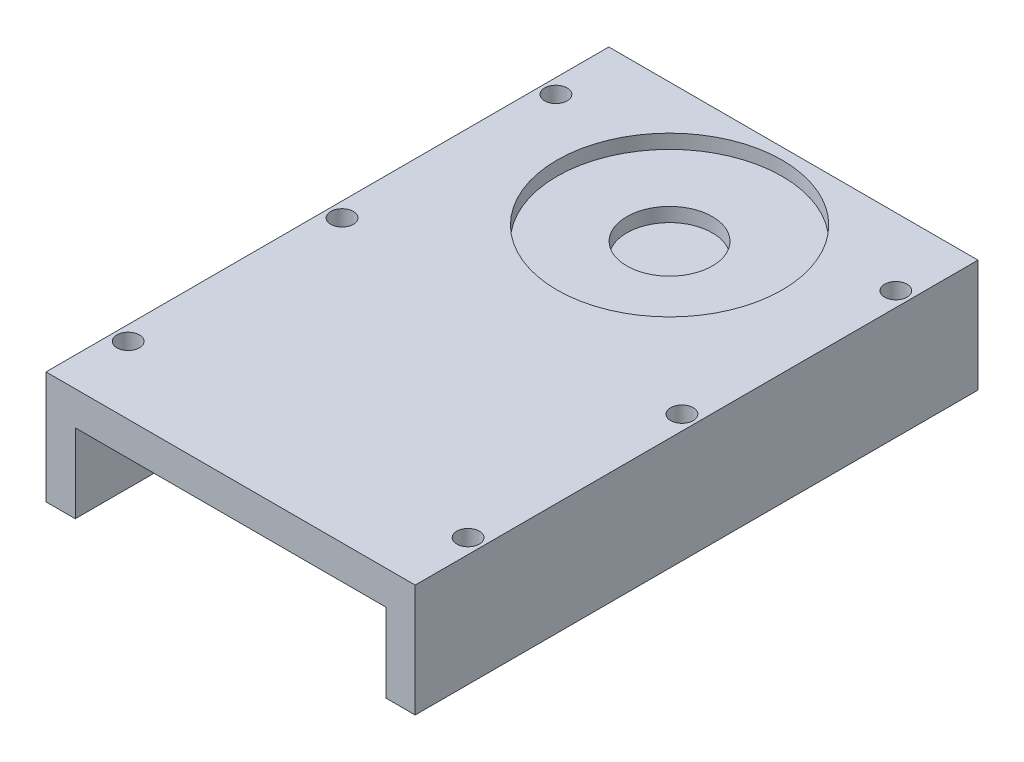
ISO-10303-21;
HEADER;
FILE_DESCRIPTION(('STEP AP214'),'2;1');
FILE_NAME('part.step','',(''),(''),'','','');
FILE_SCHEMA(('AUTOMOTIVE_DESIGN { 1 0 10303 214 1 1 1 1 }'));
ENDSEC;
DATA;
#1=APPLICATION_CONTEXT('core data for automotive mechanical design processes');
#2=APPLICATION_PROTOCOL_DEFINITION('international standard','automotive_design',2000,#1);
#3=PRODUCT_CONTEXT('',#1,'mechanical');
#4=PRODUCT('Part','Part','',(#3));
#5=PRODUCT_RELATED_PRODUCT_CATEGORY('part','',(#4));
#6=PRODUCT_DEFINITION_FORMATION('','',#4);
#7=PRODUCT_DEFINITION_CONTEXT('part definition',#1,'design');
#8=PRODUCT_DEFINITION('design','',#6,#7);
#9=PRODUCT_DEFINITION_SHAPE('','',#8);
#10=(LENGTH_UNIT() NAMED_UNIT(*) SI_UNIT(.MILLI.,.METRE.));
#11=(NAMED_UNIT(*) PLANE_ANGLE_UNIT() SI_UNIT($,.RADIAN.));
#12=(NAMED_UNIT(*) SI_UNIT($,.STERADIAN.) SOLID_ANGLE_UNIT());
#13=UNCERTAINTY_MEASURE_WITH_UNIT(LENGTH_MEASURE(1.E-05),#10,'distance_accuracy_value','');
#14=(GEOMETRIC_REPRESENTATION_CONTEXT(3) GLOBAL_UNCERTAINTY_ASSIGNED_CONTEXT((#13)) GLOBAL_UNIT_ASSIGNED_CONTEXT((#10,
#11,#12)) REPRESENTATION_CONTEXT('',''));
#15=CARTESIAN_POINT('',(0.,0.,0.));
#16=DIRECTION('',(0.,0.,1.));
#17=DIRECTION('',(1.,0.,0.));
#18=AXIS2_PLACEMENT_3D('',#15,#16,#17);
#19=CARTESIAN_POINT('',(-20.828,-8.89,63.5));
#20=DIRECTION('',(1.,0.,0.));
#21=DIRECTION('',(0.,0.,-1.));
#22=AXIS2_PLACEMENT_3D('',#19,#20,#21);
#23=PLANE('',#22);
#24=DIRECTION('',(0.,-1.,0.));
#25=VECTOR('',#24,1.);
#26=CARTESIAN_POINT('',(-20.828,-8.89,0.));
#27=LINE('',#26,#25);
#28=CARTESIAN_POINT('',(-20.828,3.81,0.));
#29=VERTEX_POINT('',#28);
#30=CARTESIAN_POINT('',(-20.828,-8.89,0.));
#31=VERTEX_POINT('',#30);
#32=EDGE_CURVE('E137',#29,#31,#27,.T.);
#33=ORIENTED_EDGE('',*,*,#32,.T.);
#34=DIRECTION('',(0.,0.,-1.));
#35=VECTOR('',#34,1.);
#36=CARTESIAN_POINT('',(-20.828,-8.89,63.5));
#37=LINE('',#36,#35);
#38=CARTESIAN_POINT('',(-20.828,-8.89,63.5));
#39=VERTEX_POINT('',#38);
#40=EDGE_CURVE('E44',#39,#31,#37,.T.);
#41=ORIENTED_EDGE('',*,*,#40,.F.);
#42=DIRECTION('',(0.,-1.,0.));
#43=VECTOR('',#42,1.);
#44=CARTESIAN_POINT('',(-20.828,-8.89,63.5));
#45=LINE('',#44,#43);
#46=CARTESIAN_POINT('',(-20.828,3.81,63.5));
#47=VERTEX_POINT('',#46);
#48=EDGE_CURVE('E97',#47,#39,#45,.T.);
#49=ORIENTED_EDGE('',*,*,#48,.F.);
#50=DIRECTION('',(0.,0.,-1.));
#51=VECTOR('',#50,1.);
#52=CARTESIAN_POINT('',(-20.828,3.81,63.5));
#53=LINE('',#52,#51);
#54=EDGE_CURVE('E11',#47,#29,#53,.T.);
#55=ORIENTED_EDGE('',*,*,#54,.T.);
#56=EDGE_LOOP('',(#33,#41,#49,#55));
#57=FACE_BOUND('',#56,.T.);
#58=ADVANCED_FACE('F35',(#57),#23,.F.);
#59=CARTESIAN_POINT('',(-17.526,-8.89,63.5));
#60=DIRECTION('',(0.,1.,0.));
#61=DIRECTION('',(-1.,0.,0.));
#62=AXIS2_PLACEMENT_3D('',#59,#60,#61);
#63=PLANE('',#62);
#64=CARTESIAN_POINT('',(-19.177,-8.89,7.62));
#65=DIRECTION('',(0.,-1.,0.));
#66=DIRECTION('',(1.,0.,0.));
#67=AXIS2_PLACEMENT_3D('',#64,#65,#66);
#68=CIRCLE('',#67,1.27);
#69=CARTESIAN_POINT('',(-17.907,-8.89,7.62));
#70=VERTEX_POINT('',#69);
#71=EDGE_CURVE('E166',#70,#70,#68,.T.);
#72=ORIENTED_EDGE('',*,*,#71,.F.);
#73=EDGE_LOOP('',(#72));
#74=FACE_BOUND('',#73,.T.);
#75=CARTESIAN_POINT('',(-19.177,-8.89,55.88));
#76=DIRECTION('',(0.,-1.,0.));
#77=DIRECTION('',(1.,0.,0.));
#78=AXIS2_PLACEMENT_3D('',#75,#76,#77);
#79=CIRCLE('',#78,1.27);
#80=CARTESIAN_POINT('',(-17.907,-8.89,55.88));
#81=VERTEX_POINT('',#80);
#82=EDGE_CURVE('E183',#81,#81,#79,.T.);
#83=ORIENTED_EDGE('',*,*,#82,.F.);
#84=EDGE_LOOP('',(#83));
#85=FACE_BOUND('',#84,.T.);
#86=CARTESIAN_POINT('',(-19.177,-8.89,31.75));
#87=DIRECTION('',(0.,-1.,0.));
#88=DIRECTION('',(1.,0.,0.));
#89=AXIS2_PLACEMENT_3D('',#86,#87,#88);
#90=CIRCLE('',#89,1.27);
#91=CARTESIAN_POINT('',(-17.907,-8.89,31.75));
#92=VERTEX_POINT('',#91);
#93=EDGE_CURVE('E179',#92,#92,#90,.T.);
#94=ORIENTED_EDGE('',*,*,#93,.F.);
#95=EDGE_LOOP('',(#94));
#96=FACE_BOUND('',#95,.T.);
#97=DIRECTION('',(1.,0.,0.));
#98=VECTOR('',#97,1.);
#99=CARTESIAN_POINT('',(-17.526,-8.89,0.));
#100=LINE('',#99,#98);
#101=CARTESIAN_POINT('',(-17.526,-8.89,0.));
#102=VERTEX_POINT('',#101);
#103=EDGE_CURVE('E139',#31,#102,#100,.T.);
#104=ORIENTED_EDGE('',*,*,#103,.T.);
#105=DIRECTION('',(0.,0.,-1.));
#106=VECTOR('',#105,1.);
#107=CARTESIAN_POINT('',(-17.526,-8.89,63.5));
#108=LINE('',#107,#106);
#109=CARTESIAN_POINT('',(-17.526,-8.89,63.5));
#110=VERTEX_POINT('',#109);
#111=EDGE_CURVE('E157',#110,#102,#108,.T.);
#112=ORIENTED_EDGE('',*,*,#111,.F.);
#113=DIRECTION('',(1.,0.,0.));
#114=VECTOR('',#113,1.);
#115=CARTESIAN_POINT('',(-17.526,-8.89,63.5));
#116=LINE('',#115,#114);
#117=EDGE_CURVE('E193',#39,#110,#116,.T.);
#118=ORIENTED_EDGE('',*,*,#117,.F.);
#119=ORIENTED_EDGE('',*,*,#40,.T.);
#120=EDGE_LOOP('',(#104,#112,#118,#119));
#121=FACE_BOUND('',#120,.T.);
#122=ADVANCED_FACE('F214',(#74,#85,#96,#121),#63,.F.);
#123=CARTESIAN_POINT('',(-17.526,0.,63.5));
#124=DIRECTION('',(-1.,0.,0.));
#125=DIRECTION('',(0.,0.,1.));
#126=AXIS2_PLACEMENT_3D('',#123,#124,#125);
#127=PLANE('',#126);
#128=DIRECTION('',(0.,1.,0.));
#129=VECTOR('',#128,1.);
#130=CARTESIAN_POINT('',(-17.526,0.,0.));
#131=LINE('',#130,#129);
#132=CARTESIAN_POINT('',(-17.526,0.,0.));
#133=VERTEX_POINT('',#132);
#134=EDGE_CURVE('E142',#102,#133,#131,.T.);
#135=ORIENTED_EDGE('',*,*,#134,.T.);
#136=DIRECTION('',(0.,0.,-1.));
#137=VECTOR('',#136,1.);
#138=CARTESIAN_POINT('',(-17.526,0.,63.5));
#139=LINE('',#138,#137);
#140=CARTESIAN_POINT('',(-17.526,0.,63.5));
#141=VERTEX_POINT('',#140);
#142=EDGE_CURVE('E154',#141,#133,#139,.T.);
#143=ORIENTED_EDGE('',*,*,#142,.F.);
#144=DIRECTION('',(0.,1.,0.));
#145=VECTOR('',#144,1.);
#146=CARTESIAN_POINT('',(-17.526,0.,63.5));
#147=LINE('',#146,#145);
#148=EDGE_CURVE('E195',#110,#141,#147,.T.);
#149=ORIENTED_EDGE('',*,*,#148,.F.);
#150=ORIENTED_EDGE('',*,*,#111,.T.);
#151=EDGE_LOOP('',(#135,#143,#149,#150));
#152=FACE_BOUND('',#151,.T.);
#153=ADVANCED_FACE('F201',(#152),#127,.F.);
#154=CARTESIAN_POINT('',(17.526,0.,63.5));
#155=DIRECTION('',(0.,1.,0.));
#156=DIRECTION('',(0.,0.,1.));
#157=AXIS2_PLACEMENT_3D('',#154,#155,#156);
#158=PLANE('',#157);
#159=DIRECTION('',(1.,0.,0.));
#160=VECTOR('',#159,1.);
#161=CARTESIAN_POINT('',(17.526,0.,0.));
#162=LINE('',#161,#160);
#163=CARTESIAN_POINT('',(17.526,0.,0.));
#164=VERTEX_POINT('',#163);
#165=EDGE_CURVE('E144',#133,#164,#162,.T.);
#166=ORIENTED_EDGE('',*,*,#165,.T.);
#167=DIRECTION('',(0.,0.,-1.));
#168=VECTOR('',#167,1.);
#169=CARTESIAN_POINT('',(17.526,0.,63.5));
#170=LINE('',#169,#168);
#171=CARTESIAN_POINT('',(17.526,0.,63.5));
#172=VERTEX_POINT('',#171);
#173=EDGE_CURVE('E126',#172,#164,#170,.T.);
#174=ORIENTED_EDGE('',*,*,#173,.F.);
#175=DIRECTION('',(1.,0.,0.));
#176=VECTOR('',#175,1.);
#177=CARTESIAN_POINT('',(17.526,0.,63.5));
#178=LINE('',#177,#176);
#179=EDGE_CURVE('E117',#141,#172,#178,.T.);
#180=ORIENTED_EDGE('',*,*,#179,.F.);
#181=ORIENTED_EDGE('',*,*,#142,.T.);
#182=EDGE_LOOP('',(#166,#174,#180,#181));
#183=FACE_BOUND('',#182,.T.);
#184=ADVANCED_FACE('F205',(#183),#158,.F.);
#185=CARTESIAN_POINT('',(17.526,-8.89,63.5));
#186=DIRECTION('',(1.,0.,0.));
#187=DIRECTION('',(0.,0.,-1.));
#188=AXIS2_PLACEMENT_3D('',#185,#186,#187);
#189=PLANE('',#188);
#190=DIRECTION('',(0.,-1.,0.));
#191=VECTOR('',#190,1.);
#192=CARTESIAN_POINT('',(17.526,-8.89,0.));
#193=LINE('',#192,#191);
#194=CARTESIAN_POINT('',(17.526,-8.89,0.));
#195=VERTEX_POINT('',#194);
#196=EDGE_CURVE('E125',#164,#195,#193,.T.);
#197=ORIENTED_EDGE('',*,*,#196,.T.);
#198=DIRECTION('',(0.,0.,-1.));
#199=VECTOR('',#198,1.);
#200=CARTESIAN_POINT('',(17.526,-8.89,63.5));
#201=LINE('',#200,#199);
#202=CARTESIAN_POINT('',(17.526,-8.89,63.5));
#203=VERTEX_POINT('',#202);
#204=EDGE_CURVE('E122',#203,#195,#201,.T.);
#205=ORIENTED_EDGE('',*,*,#204,.F.);
#206=DIRECTION('',(0.,-1.,0.));
#207=VECTOR('',#206,1.);
#208=CARTESIAN_POINT('',(17.526,-8.89,63.5));
#209=LINE('',#208,#207);
#210=EDGE_CURVE('E111',#172,#203,#209,.T.);
#211=ORIENTED_EDGE('',*,*,#210,.F.);
#212=ORIENTED_EDGE('',*,*,#173,.T.);
#213=EDGE_LOOP('',(#197,#205,#211,#212));
#214=FACE_BOUND('',#213,.T.);
#215=ADVANCED_FACE('F123',(#214),#189,.F.);
#216=CARTESIAN_POINT('',(20.828,-8.89,63.5));
#217=DIRECTION('',(0.,1.,0.));
#218=DIRECTION('',(-1.,0.,0.));
#219=AXIS2_PLACEMENT_3D('',#216,#217,#218);
#220=PLANE('',#219);
#221=CARTESIAN_POINT('',(19.177,-8.89,7.62));
#222=DIRECTION('',(0.,1.,0.));
#223=DIRECTION('',(-1.,0.,0.));
#224=AXIS2_PLACEMENT_3D('',#221,#222,#223);
#225=CIRCLE('',#224,1.27);
#226=CARTESIAN_POINT('',(17.907,-8.89,7.62));
#227=VERTEX_POINT('',#226);
#228=EDGE_CURVE('E174',#227,#227,#225,.T.);
#229=ORIENTED_EDGE('',*,*,#228,.T.);
#230=EDGE_LOOP('',(#229));
#231=FACE_BOUND('',#230,.T.);
#232=CARTESIAN_POINT('',(19.177,-8.89,55.88));
#233=DIRECTION('',(0.,1.,0.));
#234=DIRECTION('',(-1.,0.,0.));
#235=AXIS2_PLACEMENT_3D('',#232,#233,#234);
#236=CIRCLE('',#235,1.27);
#237=CARTESIAN_POINT('',(17.907,-8.89,55.88));
#238=VERTEX_POINT('',#237);
#239=EDGE_CURVE('E298',#238,#238,#236,.T.);
#240=ORIENTED_EDGE('',*,*,#239,.T.);
#241=EDGE_LOOP('',(#240));
#242=FACE_BOUND('',#241,.T.);
#243=CARTESIAN_POINT('',(19.177,-8.89,31.75));
#244=DIRECTION('',(0.,1.,0.));
#245=DIRECTION('',(-1.,0.,0.));
#246=AXIS2_PLACEMENT_3D('',#243,#244,#245);
#247=CIRCLE('',#246,1.27);
#248=CARTESIAN_POINT('',(17.907,-8.89,31.75));
#249=VERTEX_POINT('',#248);
#250=EDGE_CURVE('E294',#249,#249,#247,.T.);
#251=ORIENTED_EDGE('',*,*,#250,.T.);
#252=EDGE_LOOP('',(#251));
#253=FACE_BOUND('',#252,.T.);
#254=DIRECTION('',(1.,0.,0.));
#255=VECTOR('',#254,1.);
#256=CARTESIAN_POINT('',(20.828,-8.89,0.));
#257=LINE('',#256,#255);
#258=CARTESIAN_POINT('',(20.828,-8.89,0.));
#259=VERTEX_POINT('',#258);
#260=EDGE_CURVE('E83',#195,#259,#257,.T.);
#261=ORIENTED_EDGE('',*,*,#260,.T.);
#262=DIRECTION('',(0.,0.,-1.));
#263=VECTOR('',#262,1.);
#264=CARTESIAN_POINT('',(20.828,-8.89,63.5));
#265=LINE('',#264,#263);
#266=CARTESIAN_POINT('',(20.828,-8.89,63.5));
#267=VERTEX_POINT('',#266);
#268=EDGE_CURVE('E127',#267,#259,#265,.T.);
#269=ORIENTED_EDGE('',*,*,#268,.F.);
#270=DIRECTION('',(1.,0.,0.));
#271=VECTOR('',#270,1.);
#272=CARTESIAN_POINT('',(20.828,-8.89,63.5));
#273=LINE('',#272,#271);
#274=EDGE_CURVE('E115',#203,#267,#273,.T.);
#275=ORIENTED_EDGE('',*,*,#274,.F.);
#276=ORIENTED_EDGE('',*,*,#204,.T.);
#277=EDGE_LOOP('',(#261,#269,#275,#276));
#278=FACE_BOUND('',#277,.T.);
#279=ADVANCED_FACE('F129',(#231,#242,#253,#278),#220,.F.);
#280=CARTESIAN_POINT('',(20.828,3.81,63.5));
#281=DIRECTION('',(-1.,0.,0.));
#282=DIRECTION('',(0.,0.,1.));
#283=AXIS2_PLACEMENT_3D('',#280,#281,#282);
#284=PLANE('',#283);
#285=DIRECTION('',(0.,1.,0.));
#286=VECTOR('',#285,1.);
#287=CARTESIAN_POINT('',(20.828,3.81,0.));
#288=LINE('',#287,#286);
#289=CARTESIAN_POINT('',(20.828,3.81,0.));
#290=VERTEX_POINT('',#289);
#291=EDGE_CURVE('E90',#259,#290,#288,.T.);
#292=ORIENTED_EDGE('',*,*,#291,.T.);
#293=DIRECTION('',(0.,0.,-1.));
#294=VECTOR('',#293,1.);
#295=CARTESIAN_POINT('',(20.828,3.81,63.5));
#296=LINE('',#295,#294);
#297=CARTESIAN_POINT('',(20.828,3.81,63.5));
#298=VERTEX_POINT('',#297);
#299=EDGE_CURVE('E133',#298,#290,#296,.T.);
#300=ORIENTED_EDGE('',*,*,#299,.F.);
#301=DIRECTION('',(0.,1.,0.));
#302=VECTOR('',#301,1.);
#303=CARTESIAN_POINT('',(20.828,3.81,63.5));
#304=LINE('',#303,#302);
#305=EDGE_CURVE('E131',#267,#298,#304,.T.);
#306=ORIENTED_EDGE('',*,*,#305,.F.);
#307=ORIENTED_EDGE('',*,*,#268,.T.);
#308=EDGE_LOOP('',(#292,#300,#306,#307));
#309=FACE_BOUND('',#308,.T.);
#310=ADVANCED_FACE('F212',(#309),#284,.F.);
#311=CARTESIAN_POINT('',(-18.3144583333333,3.81,63.5));
#312=DIRECTION('',(0.,-1.,0.));
#313=DIRECTION('',(0.,0.,-1.));
#314=AXIS2_PLACEMENT_3D('',#311,#312,#313);
#315=PLANE('',#314);
#316=CARTESIAN_POINT('',(0.,3.81,13.97));
#317=DIRECTION('',(0.,1.,0.));
#318=DIRECTION('',(-1.,0.,0.));
#319=AXIS2_PLACEMENT_3D('',#316,#317,#318);
#320=CIRCLE('',#319,12.7);
#321=CARTESIAN_POINT('',(-12.7,3.81,13.97));
#322=VERTEX_POINT('',#321);
#323=EDGE_CURVE('E284',#322,#322,#320,.T.);
#324=ORIENTED_EDGE('',*,*,#323,.F.);
#325=EDGE_LOOP('',(#324));
#326=FACE_BOUND('',#325,.T.);
#327=CARTESIAN_POINT('',(19.177,3.80999999999999,7.62));
#328=DIRECTION('',(0.,-1.,0.));
#329=DIRECTION('',(0.,0.,-1.));
#330=AXIS2_PLACEMENT_3D('',#327,#328,#329);
#331=CIRCLE('',#330,1.27);
#332=CARTESIAN_POINT('',(19.177,3.80999999999999,6.35));
#333=VERTEX_POINT('',#332);
#334=EDGE_CURVE('E38',#333,#333,#331,.F.);
#335=ORIENTED_EDGE('',*,*,#334,.F.);
#336=EDGE_LOOP('',(#335));
#337=FACE_BOUND('',#336,.T.);
#338=CARTESIAN_POINT('',(19.177,3.80999999999999,55.88));
#339=DIRECTION('',(0.,-1.,0.));
#340=DIRECTION('',(0.,0.,-1.));
#341=AXIS2_PLACEMENT_3D('',#338,#339,#340);
#342=CIRCLE('',#341,1.27);
#343=CARTESIAN_POINT('',(19.177,3.80999999999999,54.61));
#344=VERTEX_POINT('',#343);
#345=EDGE_CURVE('E173',#344,#344,#342,.F.);
#346=ORIENTED_EDGE('',*,*,#345,.F.);
#347=EDGE_LOOP('',(#346));
#348=FACE_BOUND('',#347,.T.);
#349=CARTESIAN_POINT('',(19.177,3.80999999999999,31.75));
#350=DIRECTION('',(0.,-1.,0.));
#351=DIRECTION('',(0.,0.,-1.));
#352=AXIS2_PLACEMENT_3D('',#349,#350,#351);
#353=CIRCLE('',#352,1.27);
#354=CARTESIAN_POINT('',(19.177,3.80999999999999,30.48));
#355=VERTEX_POINT('',#354);
#356=EDGE_CURVE('E171',#355,#355,#353,.F.);
#357=ORIENTED_EDGE('',*,*,#356,.F.);
#358=EDGE_LOOP('',(#357));
#359=FACE_BOUND('',#358,.T.);
#360=CARTESIAN_POINT('',(-19.177,3.80999999999999,7.62));
#361=DIRECTION('',(0.,-1.,0.));
#362=DIRECTION('',(0.,0.,-1.));
#363=AXIS2_PLACEMENT_3D('',#360,#361,#362);
#364=CIRCLE('',#363,1.27);
#365=CARTESIAN_POINT('',(-19.177,3.80999999999999,6.35));
#366=VERTEX_POINT('',#365);
#367=EDGE_CURVE('E140',#366,#366,#364,.T.);
#368=ORIENTED_EDGE('',*,*,#367,.T.);
#369=EDGE_LOOP('',(#368));
#370=FACE_BOUND('',#369,.T.);
#371=CARTESIAN_POINT('',(-19.177,3.80999999999999,55.88));
#372=DIRECTION('',(0.,-1.,0.));
#373=DIRECTION('',(0.,0.,-1.));
#374=AXIS2_PLACEMENT_3D('',#371,#372,#373);
#375=CIRCLE('',#374,1.27);
#376=CARTESIAN_POINT('',(-19.177,3.80999999999999,54.61));
#377=VERTEX_POINT('',#376);
#378=EDGE_CURVE('E165',#377,#377,#375,.T.);
#379=ORIENTED_EDGE('',*,*,#378,.T.);
#380=EDGE_LOOP('',(#379));
#381=FACE_BOUND('',#380,.T.);
#382=CARTESIAN_POINT('',(-19.177,3.80999999999999,31.75));
#383=DIRECTION('',(0.,-1.,0.));
#384=DIRECTION('',(0.,0.,-1.));
#385=AXIS2_PLACEMENT_3D('',#382,#383,#384);
#386=CIRCLE('',#385,1.27);
#387=CARTESIAN_POINT('',(-19.177,3.80999999999999,30.48));
#388=VERTEX_POINT('',#387);
#389=EDGE_CURVE('E162',#388,#388,#386,.T.);
#390=ORIENTED_EDGE('',*,*,#389,.T.);
#391=EDGE_LOOP('',(#390));
#392=FACE_BOUND('',#391,.T.);
#393=DIRECTION('',(-1.,0.,0.));
#394=VECTOR('',#393,1.);
#395=CARTESIAN_POINT('',(-18.3144583333333,3.81,0.));
#396=LINE('',#395,#394);
#397=EDGE_CURVE('E149',#290,#29,#396,.T.);
#398=ORIENTED_EDGE('',*,*,#397,.T.);
#399=ORIENTED_EDGE('',*,*,#54,.F.);
#400=DIRECTION('',(-1.,0.,0.));
#401=VECTOR('',#400,1.);
#402=CARTESIAN_POINT('',(-20.828,3.81,63.5));
#403=LINE('',#402,#401);
#404=EDGE_CURVE('E53',#298,#47,#403,.T.);
#405=ORIENTED_EDGE('',*,*,#404,.F.);
#406=ORIENTED_EDGE('',*,*,#299,.T.);
#407=EDGE_LOOP('',(#398,#399,#405,#406));
#408=FACE_BOUND('',#407,.T.);
#409=ADVANCED_FACE('F211',(#326,#337,#348,#359,#370,#381,#392,#408),#315,.F.);
#410=CARTESIAN_POINT('',(0.,0.,63.5));
#411=DIRECTION('',(0.,0.,-1.));
#412=DIRECTION('',(-1.,0.,0.));
#413=AXIS2_PLACEMENT_3D('',#410,#411,#412);
#414=PLANE('',#413);
#415=ORIENTED_EDGE('',*,*,#404,.T.);
#416=ORIENTED_EDGE('',*,*,#48,.T.);
#417=ORIENTED_EDGE('',*,*,#117,.T.);
#418=ORIENTED_EDGE('',*,*,#148,.T.);
#419=ORIENTED_EDGE('',*,*,#179,.T.);
#420=ORIENTED_EDGE('',*,*,#210,.T.);
#421=ORIENTED_EDGE('',*,*,#274,.T.);
#422=ORIENTED_EDGE('',*,*,#305,.T.);
#423=EDGE_LOOP('',(#415,#416,#417,#418,#419,#420,#421,#422));
#424=FACE_BOUND('',#423,.T.);
#425=ADVANCED_FACE('F113',(#424),#414,.F.);
#426=CARTESIAN_POINT('',(0.,0.,0.));
#427=DIRECTION('',(0.,0.,-1.));
#428=DIRECTION('',(-1.,0.,0.));
#429=AXIS2_PLACEMENT_3D('',#426,#427,#428);
#430=PLANE('',#429);
#431=ORIENTED_EDGE('',*,*,#32,.F.);
#432=ORIENTED_EDGE('',*,*,#397,.F.);
#433=ORIENTED_EDGE('',*,*,#291,.F.);
#434=ORIENTED_EDGE('',*,*,#260,.F.);
#435=ORIENTED_EDGE('',*,*,#196,.F.);
#436=ORIENTED_EDGE('',*,*,#165,.F.);
#437=ORIENTED_EDGE('',*,*,#134,.F.);
#438=ORIENTED_EDGE('',*,*,#103,.F.);
#439=EDGE_LOOP('',(#431,#432,#433,#434,#435,#436,#437,#438));
#440=FACE_BOUND('',#439,.T.);
#441=ADVANCED_FACE('F208',(#440),#430,.T.);
#442=CARTESIAN_POINT('',(-19.177,54.61,31.75));
#443=DIRECTION('',(0.,-1.,0.));
#444=DIRECTION('',(1.,0.,0.));
#445=AXIS2_PLACEMENT_3D('',#442,#443,#444);
#446=CYLINDRICAL_SURFACE('',#445,1.27);
#447=ORIENTED_EDGE('',*,*,#93,.T.);
#448=EDGE_LOOP('',(#447));
#449=FACE_BOUND('',#448,.T.);
#450=ORIENTED_EDGE('',*,*,#389,.F.);
#451=EDGE_LOOP('',(#450));
#452=FACE_BOUND('',#451,.T.);
#453=ADVANCED_FACE('F239',(#449,#452),#446,.F.);
#454=CARTESIAN_POINT('',(-19.177,54.61,55.88));
#455=DIRECTION('',(0.,-1.,0.));
#456=DIRECTION('',(1.,0.,0.));
#457=AXIS2_PLACEMENT_3D('',#454,#455,#456);
#458=CYLINDRICAL_SURFACE('',#457,1.27);
#459=ORIENTED_EDGE('',*,*,#82,.T.);
#460=EDGE_LOOP('',(#459));
#461=FACE_BOUND('',#460,.T.);
#462=ORIENTED_EDGE('',*,*,#378,.F.);
#463=EDGE_LOOP('',(#462));
#464=FACE_BOUND('',#463,.T.);
#465=ADVANCED_FACE('F244',(#461,#464),#458,.F.);
#466=CARTESIAN_POINT('',(-19.177,54.61,7.62));
#467=DIRECTION('',(0.,-1.,0.));
#468=DIRECTION('',(1.,0.,0.));
#469=AXIS2_PLACEMENT_3D('',#466,#467,#468);
#470=CYLINDRICAL_SURFACE('',#469,1.27);
#471=ORIENTED_EDGE('',*,*,#71,.T.);
#472=EDGE_LOOP('',(#471));
#473=FACE_BOUND('',#472,.T.);
#474=ORIENTED_EDGE('',*,*,#367,.F.);
#475=EDGE_LOOP('',(#474));
#476=FACE_BOUND('',#475,.T.);
#477=ADVANCED_FACE('F247',(#473,#476),#470,.F.);
#478=CARTESIAN_POINT('',(19.177,54.61,31.75));
#479=DIRECTION('',(0.,-1.,0.));
#480=DIRECTION('',(1.,0.,0.));
#481=AXIS2_PLACEMENT_3D('',#478,#479,#480);
#482=CYLINDRICAL_SURFACE('',#481,1.27);
#483=ORIENTED_EDGE('',*,*,#250,.F.);
#484=EDGE_LOOP('',(#483));
#485=FACE_BOUND('',#484,.T.);
#486=ORIENTED_EDGE('',*,*,#356,.T.);
#487=EDGE_LOOP('',(#486));
#488=FACE_BOUND('',#487,.T.);
#489=ADVANCED_FACE('F251',(#485,#488),#482,.F.);
#490=CARTESIAN_POINT('',(19.177,54.61,55.88));
#491=DIRECTION('',(0.,-1.,0.));
#492=DIRECTION('',(1.,0.,0.));
#493=AXIS2_PLACEMENT_3D('',#490,#491,#492);
#494=CYLINDRICAL_SURFACE('',#493,1.27);
#495=ORIENTED_EDGE('',*,*,#239,.F.);
#496=EDGE_LOOP('',(#495));
#497=FACE_BOUND('',#496,.T.);
#498=ORIENTED_EDGE('',*,*,#345,.T.);
#499=EDGE_LOOP('',(#498));
#500=FACE_BOUND('',#499,.T.);
#501=ADVANCED_FACE('F255',(#497,#500),#494,.F.);
#502=CARTESIAN_POINT('',(19.177,54.61,7.62));
#503=DIRECTION('',(0.,-1.,0.));
#504=DIRECTION('',(1.,0.,0.));
#505=AXIS2_PLACEMENT_3D('',#502,#503,#504);
#506=CYLINDRICAL_SURFACE('',#505,1.27);
#507=ORIENTED_EDGE('',*,*,#228,.F.);
#508=EDGE_LOOP('',(#507));
#509=FACE_BOUND('',#508,.T.);
#510=ORIENTED_EDGE('',*,*,#334,.T.);
#511=EDGE_LOOP('',(#510));
#512=FACE_BOUND('',#511,.T.);
#513=ADVANCED_FACE('F259',(#509,#512),#506,.F.);
#514=CARTESIAN_POINT('',(0.,2.2225,13.97));
#515=DIRECTION('',(0.,1.,0.));
#516=DIRECTION('',(-1.,0.,0.));
#517=AXIS2_PLACEMENT_3D('',#514,#515,#516);
#518=CYLINDRICAL_SURFACE('',#517,12.7);
#519=CARTESIAN_POINT('',(0.,2.2225,13.97));
#520=DIRECTION('',(0.,1.,0.));
#521=DIRECTION('',(-1.,0.,0.));
#522=AXIS2_PLACEMENT_3D('',#519,#520,#521);
#523=CIRCLE('',#522,12.7);
#524=CARTESIAN_POINT('',(-12.7,2.2225,13.97));
#525=VERTEX_POINT('',#524);
#526=EDGE_CURVE('E288',#525,#525,#523,.T.);
#527=ORIENTED_EDGE('',*,*,#526,.F.);
#528=EDGE_LOOP('',(#527));
#529=FACE_BOUND('',#528,.T.);
#530=ORIENTED_EDGE('',*,*,#323,.T.);
#531=EDGE_LOOP('',(#530));
#532=FACE_BOUND('',#531,.T.);
#533=ADVANCED_FACE('F263',(#529,#532),#518,.F.);
#534=CARTESIAN_POINT('',(0.,2.2225,13.97));
#535=DIRECTION('',(0.,1.,0.));
#536=DIRECTION('',(-1.,0.,0.));
#537=AXIS2_PLACEMENT_3D('',#534,#535,#536);
#538=PLANE('',#537);
#539=CARTESIAN_POINT('',(0.,2.2225,13.97));
#540=DIRECTION('',(0.,1.,0.));
#541=DIRECTION('',(-1.,0.,0.));
#542=AXIS2_PLACEMENT_3D('',#539,#540,#541);
#543=CIRCLE('',#542,4.826);
#544=CARTESIAN_POINT('',(-4.826,2.2225,13.97));
#545=VERTEX_POINT('',#544);
#546=EDGE_CURVE('E285',#545,#545,#543,.T.);
#547=ORIENTED_EDGE('',*,*,#546,.F.);
#548=EDGE_LOOP('',(#547));
#549=FACE_BOUND('',#548,.T.);
#550=ORIENTED_EDGE('',*,*,#526,.T.);
#551=EDGE_LOOP('',(#550));
#552=FACE_BOUND('',#551,.T.);
#553=ADVANCED_FACE('F267',(#549,#552),#538,.T.);
#554=CARTESIAN_POINT('',(0.,0.634999999999996,13.97));
#555=DIRECTION('',(0.,1.,0.));
#556=DIRECTION('',(-1.,0.,0.));
#557=AXIS2_PLACEMENT_3D('',#554,#555,#556);
#558=CYLINDRICAL_SURFACE('',#557,4.826);
#559=CARTESIAN_POINT('',(0.,0.634999999999996,13.97));
#560=DIRECTION('',(0.,1.,0.));
#561=DIRECTION('',(-1.,0.,0.));
#562=AXIS2_PLACEMENT_3D('',#559,#560,#561);
#563=CIRCLE('',#562,4.826);
#564=CARTESIAN_POINT('',(-4.826,0.634999999999996,13.97));
#565=VERTEX_POINT('',#564);
#566=EDGE_CURVE('E283',#565,#565,#563,.T.);
#567=ORIENTED_EDGE('',*,*,#566,.F.);
#568=EDGE_LOOP('',(#567));
#569=FACE_BOUND('',#568,.T.);
#570=ORIENTED_EDGE('',*,*,#546,.T.);
#571=EDGE_LOOP('',(#570));
#572=FACE_BOUND('',#571,.T.);
#573=ADVANCED_FACE('F271',(#569,#572),#558,.F.);
#574=CARTESIAN_POINT('',(0.,0.634999999999996,13.97));
#575=DIRECTION('',(0.,1.,0.));
#576=DIRECTION('',(-1.,0.,0.));
#577=AXIS2_PLACEMENT_3D('',#574,#575,#576);
#578=PLANE('',#577);
#579=ORIENTED_EDGE('',*,*,#566,.T.);
#580=EDGE_LOOP('',(#579));
#581=FACE_BOUND('',#580,.T.);
#582=ADVANCED_FACE('F275',(#581),#578,.T.);
#583=CLOSED_SHELL('',(#58,#122,#153,#184,#215,#279,#310,#409,#425,#441,#453,#465,#477,#489,#501,
#513,#533,#553,#573,#582));
#584=MANIFOLD_SOLID_BREP('B2',#583);
#585=ADVANCED_BREP_SHAPE_REPRESENTATION('',(#18,#584),#14);
#586=SHAPE_DEFINITION_REPRESENTATION(#9,#585);
ENDSEC;
END-ISO-10303-21;
